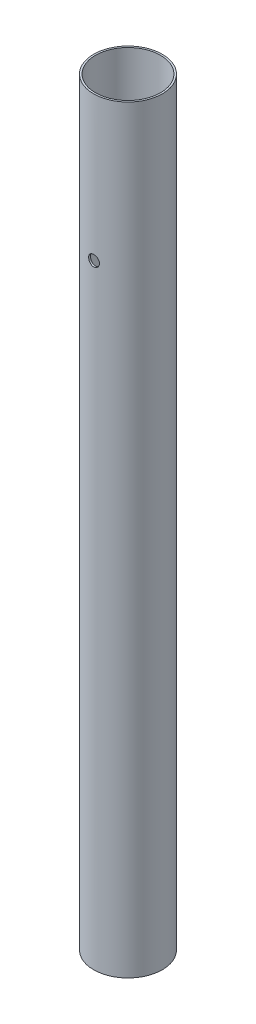
ISO-10303-21;
HEADER;
FILE_DESCRIPTION(('STEP AP214'),'2;1');
FILE_NAME('part.step','',(''),(''),'','','');
FILE_SCHEMA(('AUTOMOTIVE_DESIGN { 1 0 10303 214 1 1 1 1 }'));
ENDSEC;
DATA;
#1=APPLICATION_CONTEXT('core data for automotive mechanical design processes');
#2=APPLICATION_PROTOCOL_DEFINITION('international standard','automotive_design',2000,#1);
#3=PRODUCT_CONTEXT('',#1,'mechanical');
#4=PRODUCT('Part','Part','',(#3));
#5=PRODUCT_RELATED_PRODUCT_CATEGORY('part','',(#4));
#6=PRODUCT_DEFINITION_FORMATION('','',#4);
#7=PRODUCT_DEFINITION_CONTEXT('part definition',#1,'design');
#8=PRODUCT_DEFINITION('design','',#6,#7);
#9=PRODUCT_DEFINITION_SHAPE('','',#8);
#10=(LENGTH_UNIT() NAMED_UNIT(*) SI_UNIT(.MILLI.,.METRE.));
#11=(NAMED_UNIT(*) PLANE_ANGLE_UNIT() SI_UNIT($,.RADIAN.));
#12=(NAMED_UNIT(*) SI_UNIT($,.STERADIAN.) SOLID_ANGLE_UNIT());
#13=UNCERTAINTY_MEASURE_WITH_UNIT(LENGTH_MEASURE(1.E-05),#10,'distance_accuracy_value','');
#14=(GEOMETRIC_REPRESENTATION_CONTEXT(3) GLOBAL_UNCERTAINTY_ASSIGNED_CONTEXT((#13)) GLOBAL_UNIT_ASSIGNED_CONTEXT((#10,
#11,#12)) REPRESENTATION_CONTEXT('',''));
#15=CARTESIAN_POINT('',(0.,0.,0.));
#16=DIRECTION('',(0.,0.,1.));
#17=DIRECTION('',(1.,0.,0.));
#18=AXIS2_PLACEMENT_3D('',#15,#16,#17);
#19=CARTESIAN_POINT('',(0.,210.,0.));
#20=DIRECTION('',(0.,1.,0.));
#21=DIRECTION('',(0.,0.,1.));
#22=AXIS2_PLACEMENT_3D('',#19,#20,#21);
#23=PLANE('',#22);
#24=CARTESIAN_POINT('',(0.,210.,0.));
#25=DIRECTION('',(0.,1.,0.));
#26=DIRECTION('',(0.,0.,1.));
#27=AXIS2_PLACEMENT_3D('',#24,#25,#26);
#28=CIRCLE('',#27,9.5);
#29=CARTESIAN_POINT('',(0.,210.,9.5));
#30=VERTEX_POINT('',#29);
#31=EDGE_CURVE('E10',#30,#30,#28,.T.);
#32=ORIENTED_EDGE('',*,*,#31,.T.);
#33=EDGE_LOOP('',(#32));
#34=FACE_BOUND('',#33,.T.);
#35=CARTESIAN_POINT('',(0.,210.,0.));
#36=DIRECTION('',(0.,1.,0.));
#37=DIRECTION('',(0.,0.,1.));
#38=AXIS2_PLACEMENT_3D('',#35,#36,#37);
#39=CIRCLE('',#38,9.);
#40=CARTESIAN_POINT('',(0.,210.,9.));
#41=VERTEX_POINT('',#40);
#42=EDGE_CURVE('E50',#41,#41,#39,.T.);
#43=ORIENTED_EDGE('',*,*,#42,.F.);
#44=EDGE_LOOP('',(#43));
#45=FACE_BOUND('',#44,.T.);
#46=ADVANCED_FACE('F31',(#34,#45),#23,.T.);
#47=CARTESIAN_POINT('',(0.,0.,0.));
#48=DIRECTION('',(0.,1.,0.));
#49=DIRECTION('',(0.,0.,1.));
#50=AXIS2_PLACEMENT_3D('',#47,#48,#49);
#51=PLANE('',#50);
#52=CARTESIAN_POINT('',(0.,0.,0.));
#53=DIRECTION('',(0.,1.,0.));
#54=DIRECTION('',(0.,0.,1.));
#55=AXIS2_PLACEMENT_3D('',#52,#53,#54);
#56=CIRCLE('',#55,9.5);
#57=CARTESIAN_POINT('',(0.,0.,9.5));
#58=VERTEX_POINT('',#57);
#59=EDGE_CURVE('E45',#58,#58,#56,.T.);
#60=ORIENTED_EDGE('',*,*,#59,.F.);
#61=EDGE_LOOP('',(#60));
#62=FACE_BOUND('',#61,.T.);
#63=CARTESIAN_POINT('',(0.,0.,0.));
#64=DIRECTION('',(0.,1.,0.));
#65=DIRECTION('',(0.,0.,1.));
#66=AXIS2_PLACEMENT_3D('',#63,#64,#65);
#67=CIRCLE('',#66,9.);
#68=CARTESIAN_POINT('',(0.,0.,9.));
#69=VERTEX_POINT('',#68);
#70=EDGE_CURVE('E53',#69,#69,#67,.T.);
#71=ORIENTED_EDGE('',*,*,#70,.T.);
#72=EDGE_LOOP('',(#71));
#73=FACE_BOUND('',#72,.T.);
#74=ADVANCED_FACE('F89',(#62,#73),#51,.F.);
#75=CARTESIAN_POINT('',(0.,210.,0.));
#76=DIRECTION('',(0.,-1.,0.));
#77=DIRECTION('',(0.,0.,-1.));
#78=AXIS2_PLACEMENT_3D('',#75,#76,#77);
#79=CYLINDRICAL_SURFACE('',#78,9.5);
#80=CARTESIAN_POINT('',(0.,171.5,-9.5));
#81=CARTESIAN_POINT('',(-0.0836976001065204,171.499996590751,-9.49999861203618));
#82=CARTESIAN_POINT('',(-0.167442437394014,171.492971054897,-9.49888234231911));
#83=CARTESIAN_POINT('',(-0.332587635211271,171.46506375653,-9.49453678011783));
#84=CARTESIAN_POINT('',(-0.413985694895259,171.444168847928,-9.49130548294469));
#85=CARTESIAN_POINT('',(-0.572023766729422,171.389165821503,-9.48309267200424));
#86=CARTESIAN_POINT('',(-0.648667457404588,171.355068070666,-9.47811253172855));
#87=CARTESIAN_POINT('',(-0.795134710469102,171.274653454461,-9.46695108120927));
#88=CARTESIAN_POINT('',(-0.864959141108904,171.22833814746,-9.46076992418342));
#89=CARTESIAN_POINT('',(-0.996418466512012,171.1243781145,-9.44783324384051));
#90=CARTESIAN_POINT('',(-1.05798606000113,171.066648781236,-9.44107365911176));
#91=CARTESIAN_POINT('',(-1.17060304704611,170.941681518294,-9.42777343334239));
#92=CARTESIAN_POINT('',(-1.22165180906461,170.874443018106,-9.42123280546741));
#93=CARTESIAN_POINT('',(-1.31204764005014,170.731909155531,-9.40907168619827));
#94=CARTESIAN_POINT('',(-1.35132892424658,170.656571585241,-9.40345644380092));
#95=CARTESIAN_POINT('',(-1.4166542181194,170.500264325212,-9.39383775862891));
#96=CARTESIAN_POINT('',(-1.44269902834656,170.419294976424,-9.38983421838048));
#97=CARTESIAN_POINT('',(-1.48060162535859,170.254733051048,-9.38393240557449));
#98=CARTESIAN_POINT('',(-1.49257509267669,170.171167745216,-9.38201697623701));
#99=CARTESIAN_POINT('',(-1.50235362805524,170.003193826942,-9.38045626095234));
#100=CARTESIAN_POINT('',(-1.50015959652364,169.918785268432,-9.38081083073655));
#101=CARTESIAN_POINT('',(-1.48175980710843,169.752342028444,-9.38373437383502));
#102=CARTESIAN_POINT('',(-1.46568339888114,169.670292636708,-9.38628290415411));
#103=CARTESIAN_POINT('',(-1.4201779253579,169.510070603926,-9.39327524902392));
#104=CARTESIAN_POINT('',(-1.39074844516594,169.431898083422,-9.39771912246497));
#105=CARTESIAN_POINT('',(-1.3192392577636,169.281258187251,-9.40802379337808));
#106=CARTESIAN_POINT('',(-1.27710525865785,169.208817015619,-9.41389065039575));
#107=CARTESIAN_POINT('',(-1.1814216728908,169.07198394791,-9.42637594353948));
#108=CARTESIAN_POINT('',(-1.12787125747699,169.007592636735,-9.43299443421261));
#109=CARTESIAN_POINT('',(-1.01016734202821,168.887937883401,-9.44632735425788));
#110=CARTESIAN_POINT('',(-0.945902736525766,168.83278370453,-9.45304203303564));
#111=CARTESIAN_POINT('',(-0.808972007834455,168.734026078572,-9.46574266984972));
#112=CARTESIAN_POINT('',(-0.736305840302173,168.690422692452,-9.47172862403949));
#113=CARTESIAN_POINT('',(-0.58453630688462,168.61599678625,-9.48230461469925));
#114=CARTESIAN_POINT('',(-0.505428458120286,168.585183259369,-9.48689366833474));
#115=CARTESIAN_POINT('',(-0.343072096390943,168.537309692998,-9.49415073946819));
#116=CARTESIAN_POINT('',(-0.259823894418563,168.520248622178,-9.49681890101704));
#117=CARTESIAN_POINT('',(-0.0924923680311061,168.500510863084,-9.49991434597553));
#118=CARTESIAN_POINT('',(-0.00842716740137882,168.497684061576,-9.50036501369999));
#119=CARTESIAN_POINT('',(0.158976265712531,168.506095824844,-9.49903852875433));
#120=CARTESIAN_POINT('',(0.24231452311222,168.517333905633,-9.4972614527432));
#121=CARTESIAN_POINT('',(0.405439567370632,168.553431581316,-9.49169362069365));
#122=CARTESIAN_POINT('',(0.485243062795079,168.578217495579,-9.48791376028194));
#123=CARTESIAN_POINT('',(0.639561861197122,168.640629167573,-9.47876264558505));
#124=CARTESIAN_POINT('',(0.714076892756956,168.678255583736,-9.4733913096943));
#125=CARTESIAN_POINT('',(0.856359938682373,168.76562849511,-9.4615955819989));
#126=CARTESIAN_POINT('',(0.924069207311129,168.815469543787,-9.45516310943481));
#127=CARTESIAN_POINT('',(1.05021609132262,168.925726002589,-9.44198475905152));
#128=CARTESIAN_POINT('',(1.10865310573566,168.986142097589,-9.43523886095462));
#129=CARTESIAN_POINT('',(1.21514760920431,169.116504265563,-9.42211913600068));
#130=CARTESIAN_POINT('',(1.26310409838576,169.186533313588,-9.41574932753235));
#131=CARTESIAN_POINT('',(1.34657266649326,169.333741312266,-9.40417594303638));
#132=CARTESIAN_POINT('',(1.38208510941916,169.4109200537,-9.39897233289797));
#133=CARTESIAN_POINT('',(1.43950349612765,169.569944110939,-9.39035010587673));
#134=CARTESIAN_POINT('',(1.46146126125825,169.651770331162,-9.38692469878068));
#135=CARTESIAN_POINT('',(1.49131110199775,169.81800766724,-9.38222912838246));
#136=CARTESIAN_POINT('',(1.49920426388363,169.902418582954,-9.38095879863367));
#137=CARTESIAN_POINT('',(1.5006729373316,170.070421672991,-9.38072387634563));
#138=CARTESIAN_POINT('',(1.49440732883688,170.15401246558,-9.38173369742788));
#139=CARTESIAN_POINT('',(1.46807821019622,170.31893513302,-9.38588947240367));
#140=CARTESIAN_POINT('',(1.44801473210917,170.400267013119,-9.38903542133397));
#141=CARTESIAN_POINT('',(1.39471776903662,170.558311064846,-9.39709967714348));
#142=CARTESIAN_POINT('',(1.3614965806929,170.635027473008,-9.40201632881049));
#143=CARTESIAN_POINT('',(1.28284324745908,170.781823568325,-9.41306982252276));
#144=CARTESIAN_POINT('',(1.23741059974181,170.851902982031,-9.41920671481075));
#145=CARTESIAN_POINT('',(1.13505145080214,170.984240968063,-9.4320909582884));
#146=CARTESIAN_POINT('',(1.0780076272868,171.046408241589,-9.43884411780419));
#147=CARTESIAN_POINT('',(0.954293245344258,171.160343480553,-9.45215249855794));
#148=CARTESIAN_POINT('',(0.887620460616881,171.212109034385,-9.4587076735952));
#149=CARTESIAN_POINT('',(0.746056649485077,171.30405856521,-9.47092780190555));
#150=CARTESIAN_POINT('',(0.671117681090879,171.344169487173,-9.47658704267683));
#151=CARTESIAN_POINT('',(0.515509688205488,171.411173596546,-9.48632189921254));
#152=CARTESIAN_POINT('',(0.434846589899649,171.438080232267,-9.49039912533837));
#153=CARTESIAN_POINT('',(0.294869549677877,171.471929091052,-9.4955986667772));
#154=CARTESIAN_POINT('',(0.236411965071409,171.482439241916,-9.49724053176745));
#155=CARTESIAN_POINT('',(0.118644158414184,171.496475854084,-9.49944168248486));
#156=CARTESIAN_POINT('',(0.0593339487629808,171.500002416846,-9.50000098393949));
#157=CARTESIAN_POINT('',(0.,171.5,-9.5));
#158=B_SPLINE_CURVE_WITH_KNOTS('',3,(#80,#81,#82,#83,#84,#85,#86,#87,#88,#89,#90,#91,#92,#93,
#94,#95,#96,#97,#98,#99,#100,#101,#102,#103,#104,#105,#106,#107,#108,#109,#110,#111,#112,#113,
#114,#115,#116,#117,#118,#119,#120,#121,#122,#123,#124,#125,#126,#127,#128,#129,#130,#131,#132,
#133,#134,#135,#136,#137,#138,#139,#140,#141,#142,#143,#144,#145,#146,#147,#148,#149,#150,#151,
#152,#153,#154,#155,#156,#157),.UNSPECIFIED.,.T.,.F.,(4,2,2,2,2,2,2,2,2,2,2,2,2,2,2,2,2,2,2,2,2,
2,2,2,2,2,2,2,2,2,2,2,2,2,2,2,2,2,4),(0.,0.250875955706264,0.501990044469081,0.752907354824661,
1.00379267580461,1.2566125744651,1.50944764769343,1.76367086508285,2.01787870505205,
2.26998174901984,2.52206877086914,2.77183199835413,3.02160298681439,3.27245685757922,
3.52332894479685,3.77698595667627,4.03064430741766,4.28448071735227,4.53829808968866,
4.78943303847652,5.0405593456862,5.2903332848928,5.54012003389346,5.79190509693549,
6.04370647245532,6.29783677445572,6.55195964228956,6.80510484781958,7.05823050087968,
7.30852987505233,7.55882866766461,7.80889409144678,8.05896981366681,8.31171040651356,
8.56450952903009,8.81886068521236,9.07295224922779,9.25080295634069,9.42865107961777),.UNSPECIFIED.);
#159=CARTESIAN_POINT('',(0.,171.5,-9.5));
#160=VERTEX_POINT('',#159);
#161=EDGE_CURVE('E78',#160,#160,#158,.T.);
#162=ORIENTED_EDGE('',*,*,#161,.T.);
#163=EDGE_LOOP('',(#162));
#164=FACE_BOUND('',#163,.T.);
#165=CARTESIAN_POINT('',(1.5,170.,9.38083151964686));
#166=CARTESIAN_POINT('',(1.49999658455055,169.916309730994,9.38083297404066));
#167=CARTESIAN_POINT('',(1.49297223784084,169.83257220576,9.38196360092028));
#168=CARTESIAN_POINT('',(1.46507009131939,169.667442196307,9.38636039550341));
#169=CARTESIAN_POINT('',(1.44417911871312,169.58605201877,9.38962859377943));
#170=CARTESIAN_POINT('',(1.38918760267279,169.428030626815,9.39792135372632));
#171=CARTESIAN_POINT('',(1.35509761216466,169.351395667139,9.40294451195283));
#172=CARTESIAN_POINT('',(1.27470128030859,169.204943089764,9.414179545352));
#173=CARTESIAN_POINT('',(1.22839647880733,169.135124614273,9.42039127066217));
#174=CARTESIAN_POINT('',(1.12444713836387,169.003658755913,9.43336503838525));
#175=CARTESIAN_POINT('',(1.06671563821398,168.942080515686,9.44013105201471));
#176=CARTESIAN_POINT('',(0.941739545888724,168.829442925427,9.45341567106039));
#177=CARTESIAN_POINT('',(0.874494412511279,168.778384174223,9.45993426237471));
#178=CARTESIAN_POINT('',(0.731954548292164,168.687977744035,9.47203134599669));
#179=CARTESIAN_POINT('',(0.656618750818359,168.648694057007,9.47760463238817));
#180=CARTESIAN_POINT('',(0.500315336961971,168.583363834375,9.48713906529767));
#181=CARTESIAN_POINT('',(0.419348049999343,168.557316525233,9.49110030602129));
#182=CARTESIAN_POINT('',(0.25479321450393,168.519408932187,9.49693629805995));
#183=CARTESIAN_POINT('',(0.171232996932499,168.507432673184,9.4988280968723));
#184=CARTESIAN_POINT('',(0.00326909893889104,168.497646790535,9.5003705446193));
#185=CARTESIAN_POINT('',(-0.0811345294603289,168.499836298441,9.50002133094164));
#186=CARTESIAN_POINT('',(-0.247597304848639,168.518228771821,9.49713466336618));
#187=CARTESIAN_POINT('',(-0.3296706258939,168.534306947759,9.49461669627846));
#188=CARTESIAN_POINT('',(-0.489939598315301,168.579824191671,9.48769715323518));
#189=CARTESIAN_POINT('',(-0.568135141212466,168.609263633184,9.48329552461823));
#190=CARTESIAN_POINT('',(-0.718803540216121,168.680793756153,9.47306987014884));
#191=CARTESIAN_POINT('',(-0.791251288178859,168.722936457125,9.46724001448607));
#192=CARTESIAN_POINT('',(-0.928093849593969,168.818638783527,9.45480671150476));
#193=CARTESIAN_POINT('',(-0.992488076174243,168.872199240216,9.44820320787719));
#194=CARTESIAN_POINT('',(-1.1121320674923,168.989910476114,9.43487320037046));
#195=CARTESIAN_POINT('',(-1.16727457805413,169.05417026277,9.42814614020982));
#196=CARTESIAN_POINT('',(-1.26601092962898,169.191087124167,9.41539709463343));
#197=CARTESIAN_POINT('',(-1.30960468415934,169.263744261786,9.40937511449785));
#198=CARTESIAN_POINT('',(-1.38402357522716,169.415510946437,9.39871800561222));
#199=CARTESIAN_POINT('',(-1.4148368179779,169.494626422159,9.39408416980429));
#200=CARTESIAN_POINT('',(-1.46270749784294,169.656999420591,9.38675017598398));
#201=CARTESIAN_POINT('',(-1.47976601505946,169.740256617523,9.38404986614158));
#202=CARTESIAN_POINT('',(-1.49949411042943,169.907592955659,9.38091773533559));
#203=CARTESIAN_POINT('',(-1.50231612080203,169.991653691218,9.38046188392375));
#204=CARTESIAN_POINT('',(-1.4938963689811,170.159047058933,9.38180638869071));
#205=CARTESIAN_POINT('',(-1.48265509215639,170.242379716117,9.38360666700331));
#206=CARTESIAN_POINT('',(-1.44655746438407,170.405473669363,9.38923845197488));
#207=CARTESIAN_POINT('',(-1.42177781446732,170.485252371713,9.39305851175888));
#208=CARTESIAN_POINT('',(-1.35938693205191,170.639524340716,9.4022899197254));
#209=CARTESIAN_POINT('',(-1.3217750034913,170.714017320389,9.40770135422673));
#210=CARTESIAN_POINT('',(-1.23442398163625,170.856284315317,9.41956203589073));
#211=CARTESIAN_POINT('',(-1.18458667109845,170.923997325605,9.42601953670219));
#212=CARTESIAN_POINT('',(-1.07433532022965,171.050153488593,9.43922022959441));
#213=CARTESIAN_POINT('',(-1.01392061491125,171.10859605803,9.44596343961713));
#214=CARTESIAN_POINT('',(-0.883556250112777,171.215104037933,9.45905128553892));
#215=CARTESIAN_POINT('',(-0.813523322567932,171.263068133763,9.46539164279549));
#216=CARTESIAN_POINT('',(-0.666305394879827,171.346550031229,9.47689193046182));
#217=CARTESIAN_POINT('',(-0.589120607345019,171.382068202704,9.48205189594613));
#218=CARTESIAN_POINT('',(-0.430099180755803,171.439490080176,9.49059133505206));
#219=CARTESIAN_POINT('',(-0.348282544696119,171.461448081895,9.49397790107197));
#220=CARTESIAN_POINT('',(-0.182065541000527,171.49130163797,9.49861883842448));
#221=CARTESIAN_POINT('',(-0.0976653637496369,171.499198226007,9.49987336648691));
#222=CARTESIAN_POINT('',(0.0703424890561658,171.500677486119,9.50010700904781));
#223=CARTESIAN_POINT('',(0.153948809855681,171.494414773802,9.49911070212592));
#224=CARTESIAN_POINT('',(0.318903288593768,171.468086009826,9.49500446266303));
#225=CARTESIAN_POINT('',(0.400251456141505,171.448020016915,9.4918945391176));
#226=CARTESIAN_POINT('',(0.558330315524413,171.394711238641,9.48390902705529));
#227=CARTESIAN_POINT('',(0.635065084473797,171.36148029105,9.47903502511627));
#228=CARTESIAN_POINT('',(0.78189387143712,171.282801713074,9.46805518209959));
#229=CARTESIAN_POINT('',(0.851987627392477,171.237353600862,9.46194929244058));
#230=CARTESIAN_POINT('',(0.984326499290177,171.134976723638,9.44910438099924));
#231=CARTESIAN_POINT('',(1.04648306132952,171.077934215668,9.44235947063351));
#232=CARTESIAN_POINT('',(1.16039729972464,170.954226966935,9.42903896923987));
#233=CARTESIAN_POINT('',(1.21215253557012,170.887559974227,9.42246341826431));
#234=CARTESIAN_POINT('',(1.30409009743287,170.746001568518,9.41018172735959));
#235=CARTESIAN_POINT('',(1.34419772972858,170.671061150686,9.40448130469082));
#236=CARTESIAN_POINT('',(1.41119529560835,170.515450247748,9.39466254048804));
#237=CARTESIAN_POINT('',(1.43809871074205,170.434785703743,9.39054258623338));
#238=CARTESIAN_POINT('',(1.47193913254667,170.294817128211,9.38528558640041));
#239=CARTESIAN_POINT('',(1.48244550005068,170.236370034016,9.38362436450214));
#240=CARTESIAN_POINT('',(1.49647709113171,170.118623199367,9.38139682399235));
#241=CARTESIAN_POINT('',(1.50000242102603,170.059323471912,9.38083048870633));
#242=CARTESIAN_POINT('',(1.5,170.,9.38083151964686));
#243=B_SPLINE_CURVE_WITH_KNOTS('',3,(#165,#166,#167,#168,#169,#170,#171,#172,#173,#174,#175,
#176,#177,#178,#179,#180,#181,#182,#183,#184,#185,#186,#187,#188,#189,#190,#191,#192,#193,#194,
#195,#196,#197,#198,#199,#200,#201,#202,#203,#204,#205,#206,#207,#208,#209,#210,#211,#212,#213,
#214,#215,#216,#217,#218,#219,#220,#221,#222,#223,#224,#225,#226,#227,#228,#229,#230,#231,#232,
#233,#234,#235,#236,#237,#238,#239,#240,#241,#242),.UNSPECIFIED.,.T.,.F.,(4,2,2,2,2,2,2,2,2,2,2,
2,2,2,2,2,2,2,2,2,2,2,2,2,2,2,2,2,2,2,2,2,2,2,2,2,2,2,4),(0.,0.250853927262134,
0.501946498416266,0.752838728320962,1.00369934487583,1.2565480788977,1.50941120251429,
1.76362459165417,2.01782312279829,2.26991148848838,2.52198439977627,2.77181572176524,
3.02165402872709,3.27252964579773,3.52342353390932,3.77705047333305,4.03067931198402,
4.28454365571374,4.53838806257511,4.7895086664625,5.04062060361752,5.29032441173719,
5.54004176670729,5.79183509438419,6.04364425767607,6.29778980620822,6.55192780199649,
6.80504150202871,7.05813659442522,7.3084813238685,7.55882498785124,7.80894405482682,
8.05907298755213,8.3117856936091,8.56455762574337,8.81891644248642,9.07301501496297,
9.25083440456604,9.42865108605879),.UNSPECIFIED.);
#244=CARTESIAN_POINT('',(1.5,170.,9.38083151964686));
#245=VERTEX_POINT('',#244);
#246=EDGE_CURVE('E73',#245,#245,#243,.T.);
#247=ORIENTED_EDGE('',*,*,#246,.T.);
#248=EDGE_LOOP('',(#247));
#249=FACE_BOUND('',#248,.T.);
#250=ORIENTED_EDGE('',*,*,#31,.F.);
#251=EDGE_LOOP('',(#250));
#252=FACE_BOUND('',#251,.T.);
#253=ORIENTED_EDGE('',*,*,#59,.T.);
#254=EDGE_LOOP('',(#253));
#255=FACE_BOUND('',#254,.T.);
#256=ADVANCED_FACE('F33',(#164,#249,#252,#255),#79,.T.);
#257=CARTESIAN_POINT('',(0.,210.,0.));
#258=DIRECTION('',(0.,-1.,0.));
#259=DIRECTION('',(0.,0.,-1.));
#260=AXIS2_PLACEMENT_3D('',#257,#258,#259);
#261=CYLINDRICAL_SURFACE('',#260,9.);
#262=CARTESIAN_POINT('',(0.,171.5,-9.));
#263=CARTESIAN_POINT('',(-0.0836345429749285,171.499996646631,-8.99999856701294));
#264=CARTESIAN_POINT('',(-0.167314729103292,171.492981635019,-8.9988220674782));
#265=CARTESIAN_POINT('',(-0.332328133003824,171.465118604741,-8.99424206964832));
#266=CARTESIAN_POINT('',(-0.413659120775546,171.444257865853,-8.99083652354334));
#267=CARTESIAN_POINT('',(-0.571562848327585,171.389350730844,-8.9821804094187));
#268=CARTESIAN_POINT('',(-0.64813942105914,171.355315120616,-8.97693135095516));
#269=CARTESIAN_POINT('',(-0.794485105186768,171.275052624769,-8.96516536249242));
#270=CARTESIAN_POINT('',(-0.864254993927156,171.22882713351,-8.9586485775266));
#271=CARTESIAN_POINT('',(-0.995683568575008,171.125026949708,-8.94499990474988));
#272=CARTESIAN_POINT('',(-1.05726774212098,171.067358531218,-8.93786323088914));
#273=CARTESIAN_POINT('',(-1.16993309919595,170.942511218916,-8.92381576126039));
#274=CARTESIAN_POINT('',(-1.22101361963458,170.875331725126,-8.916904979776));
#275=CARTESIAN_POINT('',(-1.31152027536308,170.732857420282,-8.90404539455868));
#276=CARTESIAN_POINT('',(-1.3508727317166,170.657515197917,-8.89810277454981));
#277=CARTESIAN_POINT('',(-1.41633501924673,170.50117426142,-8.88791873876805));
#278=CARTESIAN_POINT('',(-1.44244574493937,170.420175929793,-8.88367720808584));
#279=CARTESIAN_POINT('',(-1.48044862667088,170.255611835086,-8.87742322105653));
#280=CARTESIAN_POINT('',(-1.49246941748124,170.172076558099,-8.8753906109142));
#281=CARTESIAN_POINT('',(-1.50235003517393,170.00415183387,-8.87372363361989));
#282=CARTESIAN_POINT('',(-1.5002108642334,169.9197624475,-8.87408909674328));
#283=CARTESIAN_POINT('',(-1.48193705903769,169.753443283235,-8.87715857318133));
#284=CARTESIAN_POINT('',(-1.46594692913387,169.671497117873,-8.8798384399135));
#285=CARTESIAN_POINT('',(-1.42065188424207,169.511467209303,-8.88719697126605));
#286=CARTESIAN_POINT('',(-1.39134651259185,169.433383598667,-8.89187570443963));
#287=CARTESIAN_POINT('',(-1.32010634765635,169.282862705935,-8.9027308760046));
#288=CARTESIAN_POINT('',(-1.27811154832783,169.210454356351,-8.90891440264395));
#289=CARTESIAN_POINT('',(-1.18272721053446,169.073657359677,-8.92207751049005));
#290=CARTESIAN_POINT('',(-1.12933675239258,169.009269360527,-8.92905715592572));
#291=CARTESIAN_POINT('',(-1.01188932729543,168.889504348516,-8.94313216727871));
#292=CARTESIAN_POINT('',(-0.947708378323876,168.834248888876,-8.95022789538991));
#293=CARTESIAN_POINT('',(-0.810921149388988,168.735273342401,-8.96365560838034));
#294=CARTESIAN_POINT('',(-0.738314815143854,168.69155332989,-8.96998758833847));
#295=CARTESIAN_POINT('',(-0.586623549700028,168.616878663718,-8.98118335735747));
#296=CARTESIAN_POINT('',(-0.507533235338799,168.585934748401,-8.98604591044468));
#297=CARTESIAN_POINT('',(-0.34517900736164,168.537803470852,-8.99374501807596));
#298=CARTESIAN_POINT('',(-0.26191544350768,168.520614957816,-8.99658174210284));
#299=CARTESIAN_POINT('',(-0.0946259407809719,168.500647184923,-8.99988677905612));
#300=CARTESIAN_POINT('',(-0.0106204422906043,168.497701056917,-9.00038251807671));
#301=CARTESIAN_POINT('',(0.156683863733934,168.505856806657,-8.99902484652702));
#302=CARTESIAN_POINT('',(0.239982698335223,168.51695814388,-8.99717152634471));
#303=CARTESIAN_POINT('',(0.402993705328054,168.552754909601,-8.99134096162921));
#304=CARTESIAN_POINT('',(0.48272452103122,168.577367725034,-8.98737662880787));
#305=CARTESIAN_POINT('',(0.636928130916258,168.63940071092,-8.97776678673215));
#306=CARTESIAN_POINT('',(0.711400629545827,168.676821600581,-8.97212118307212));
#307=CARTESIAN_POINT('',(0.853698413681378,168.763790674818,-8.95970709781445));
#308=CARTESIAN_POINT('',(0.921459150562295,168.8134430937,-8.95292913532213));
#309=CARTESIAN_POINT('',(1.04774615130162,168.923322389231,-8.9390308043514));
#310=CARTESIAN_POINT('',(1.10627174381795,168.983550033966,-8.93191041102928));
#311=CARTESIAN_POINT('',(1.21304566779481,169.113618528843,-8.91804105141507));
#312=CARTESIAN_POINT('',(1.26118125666825,169.183552499309,-8.91129669682263));
#313=CARTESIAN_POINT('',(1.345021386177,169.330611781483,-8.8990291786673));
#314=CARTESIAN_POINT('',(1.38072632086189,169.407736865136,-8.89350597639612));
#315=CARTESIAN_POINT('',(1.43852299888389,169.566673839687,-8.88434072218623));
#316=CARTESIAN_POINT('',(1.46067085952877,169.648464857018,-8.88069092586639));
#317=CARTESIAN_POINT('',(1.49090127226697,169.814672077533,-8.87566630101156));
#318=CARTESIAN_POINT('',(1.4989850471677,169.899088051839,-8.87429127469633));
#319=CARTESIAN_POINT('',(1.50082371962841,170.067023099577,-8.87398039850407));
#320=CARTESIAN_POINT('',(1.49475608167512,170.150540227145,-8.8750143390339));
#321=CARTESIAN_POINT('',(1.46884790337412,170.31534754883,-8.87933868872237));
#322=CARTESIAN_POINT('',(1.44900740766749,170.396637750165,-8.88262909056728));
#323=CARTESIAN_POINT('',(1.39618469375695,170.554615062376,-8.89108413769031));
#324=CARTESIAN_POINT('',(1.36321775436028,170.631307406034,-8.89624660331802));
#325=CARTESIAN_POINT('',(1.28509620234956,170.778101401517,-8.90786621353324));
#326=CARTESIAN_POINT('',(1.23994098524915,170.848202726223,-8.91432342233039));
#327=CARTESIAN_POINT('',(1.1380913306233,170.980721349865,-8.92790072427373));
#328=CARTESIAN_POINT('',(1.08126633815619,171.04303761002,-8.93502777345781));
#329=CARTESIAN_POINT('',(0.95796541882814,171.157310962685,-8.94908623416504));
#330=CARTESIAN_POINT('',(0.891487267747582,171.209265661183,-8.95601760015928));
#331=CARTESIAN_POINT('',(0.750221501784171,171.30166896092,-8.96895917785332));
#332=CARTESIAN_POINT('',(0.675379672519698,171.342035623588,-8.97496269751863));
#333=CARTESIAN_POINT('',(0.5199078416274,171.409561690766,-8.98530700561065));
#334=CARTESIAN_POINT('',(0.439283696898017,171.436734248648,-8.98964944906489));
#335=CARTESIAN_POINT('',(0.298621986027251,171.471203164476,-8.99523474499773));
#336=CARTESIAN_POINT('',(0.239435298179077,171.48198468177,-8.99701216364015));
#337=CARTESIAN_POINT('',(0.12017358619189,171.496384242707,-8.99939529591672));
#338=CARTESIAN_POINT('',(0.0600985773650987,171.500002409682,-9.00000102972385));
#339=CARTESIAN_POINT('',(0.,171.5,-9.));
#340=B_SPLINE_CURVE_WITH_KNOTS('',3,(#262,#263,#264,#265,#266,#267,#268,#269,#270,#271,#272,
#273,#274,#275,#276,#277,#278,#279,#280,#281,#282,#283,#284,#285,#286,#287,#288,#289,#290,#291,
#292,#293,#294,#295,#296,#297,#298,#299,#300,#301,#302,#303,#304,#305,#306,#307,#308,#309,#310,
#311,#312,#313,#314,#315,#316,#317,#318,#319,#320,#321,#322,#323,#324,#325,#326,#327,#328,#329,
#330,#331,#332,#333,#334,#335,#336,#337,#338,#339),.UNSPECIFIED.,.T.,.F.,(4,2,2,2,2,2,2,2,2,2,2,
2,2,2,2,2,2,2,2,2,2,2,2,2,2,2,2,2,2,2,2,2,2,2,2,2,2,2,4),(0.,0.250683950963103,
0.501598527417252,0.75230812021517,1.00298904760486,1.25581494637399,1.50865680101914,
1.76305512494304,2.01743626125706,2.26947646262051,2.5214988259253,2.77092313056243,
3.02035599015228,3.27098733979534,3.52163892408343,3.77539661946794,4.02915594981509,
4.28312813349542,4.5370790671269,4.78804730094839,5.03900587821516,5.28844684203848,
5.53790181495639,5.78956095376215,6.0412383783257,6.29552293204577,6.54979942425565,
6.80301613405063,7.05621082671967,7.30624745713618,7.55628327712878,7.80602890935732,
8.05578693017601,8.30850830516035,8.56128800327384,8.81581338964319,9.07008451278042,
9.25022548898411,9.43036336366181),.UNSPECIFIED.);
#341=CARTESIAN_POINT('',(0.,171.5,-9.));
#342=VERTEX_POINT('',#341);
#343=EDGE_CURVE('E36',#342,#342,#340,.T.);
#344=ORIENTED_EDGE('',*,*,#343,.F.);
#345=EDGE_LOOP('',(#344));
#346=FACE_BOUND('',#345,.T.);
#347=CARTESIAN_POINT('',(1.5,170.,8.87411967464942));
#348=CARTESIAN_POINT('',(1.4999966390526,169.916374551112,8.87412118440766));
#349=CARTESIAN_POINT('',(1.49298310142239,169.832703436385,8.8753145552884));
#350=CARTESIAN_POINT('',(1.46512645684524,169.667708874068,8.87995474420907));
#351=CARTESIAN_POINT('',(1.44427059618579,169.58638766375,8.88340364034856));
#352=CARTESIAN_POINT('',(1.38937772620029,169.428504629986,8.89215365593394));
#353=CARTESIAN_POINT('',(1.35535173295866,169.3519388908,8.8974532270317));
#354=CARTESIAN_POINT('',(1.27511189813422,169.205611427172,8.90930563268603));
#355=CARTESIAN_POINT('',(1.22889942810094,169.135848938254,8.91585832618484));
#356=CARTESIAN_POINT('',(1.12511251617979,169.004412290153,8.92955082691565));
#357=CARTESIAN_POINT('',(1.06744142935939,168.942814921168,8.93669530396241));
#358=CARTESIAN_POINT('',(0.942583202817229,168.830124015883,8.95072488401674));
#359=CARTESIAN_POINT('',(0.87539549949001,168.779031102131,8.95760997163182));
#360=CARTESIAN_POINT('',(0.732913721969014,168.688511259668,8.97039442189481));
#361=CARTESIAN_POINT('',(0.657573648874038,168.649155795361,8.97628765459366));
#362=CARTESIAN_POINT('',(0.501237373034338,168.583687357682,8.98637242174293));
#363=CARTESIAN_POINT('',(0.420241538446923,168.557573523269,8.99056406683605));
#364=CARTESIAN_POINT('',(0.255686235806551,168.51956447901,8.99674040834627));
#365=CARTESIAN_POINT('',(0.172157332007571,168.507540250397,8.99874511866543));
#366=CARTESIAN_POINT('',(0.00424517131548999,168.497650547508,9.00039047605668));
#367=CARTESIAN_POINT('',(-0.0801380271173271,168.499784110852,9.00003128381585));
#368=CARTESIAN_POINT('',(-0.246481311047316,168.518048810917,8.99700515058833));
#369=CARTESIAN_POINT('',(-0.328457118420079,168.534041098045,8.99436110215438));
#370=CARTESIAN_POINT('',(-0.488545187767068,168.579350644548,8.98708787262982));
#371=CARTESIAN_POINT('',(-0.566657331990893,168.608668309754,8.98245863107927));
#372=CARTESIAN_POINT('',(-0.717213688669577,168.679934384189,8.97169619107174));
#373=CARTESIAN_POINT('',(-0.789630313811416,168.721940007249,8.96555620396128));
#374=CARTESIAN_POINT('',(-0.926439317907975,168.817347693581,8.95245442842898));
#375=CARTESIAN_POINT('',(-0.990831046749513,168.870750679226,8.94549257351481));
#376=CARTESIAN_POINT('',(-1.11058276406799,168.988207283972,8.93142160939558));
#377=CARTESIAN_POINT('',(-1.16582370135193,169.052382256941,8.92431173838625));
#378=CARTESIAN_POINT('',(-1.26477275306885,169.189152254129,8.91082775870883));
#379=CARTESIAN_POINT('',(-1.30848076111946,169.26174735601,8.90445365682795));
#380=CARTESIAN_POINT('',(-1.38314666069298,169.413434985126,8.8931625273709));
#381=CARTESIAN_POINT('',(-1.41409021636756,169.492534698855,8.88824713981561));
#382=CARTESIAN_POINT('',(-1.46221792248938,169.654909443385,8.88045713213928));
#383=CARTESIAN_POINT('',(-1.47940328446077,169.738184105859,8.87758233232993));
#384=CARTESIAN_POINT('',(-1.49935913092756,169.905479693697,8.8742337565327));
#385=CARTESIAN_POINT('',(-1.50229932474746,169.989479827821,8.87373171455201));
#386=CARTESIAN_POINT('',(-1.49413362160948,170.156772003014,8.87511020869417));
#387=CARTESIAN_POINT('',(-1.4830282671748,170.240064071308,8.87699065279112));
#388=CARTESIAN_POINT('',(-1.44723140095686,170.403036655514,8.88289612473011));
#389=CARTESIAN_POINT('',(-1.42262627438783,170.482736683927,8.88690751151009));
#390=CARTESIAN_POINT('',(-1.36061891411537,170.636882099768,8.89661143803301));
#391=CARTESIAN_POINT('',(-1.32321591486056,170.711327172531,8.90230407834347));
#392=CARTESIAN_POINT('',(-1.23627400393753,170.853604756644,8.91479477038436));
#393=CARTESIAN_POINT('',(-1.18662633849561,170.921369943654,8.92160253360208));
#394=CARTESIAN_POINT('',(-1.07675367942478,171.047668119617,8.9355280000792));
#395=CARTESIAN_POINT('',(-1.01652794183042,171.106200458666,8.94264572511199));
#396=CARTESIAN_POINT('',(-0.88645684219728,171.212991135637,8.95647853270958));
#397=CARTESIAN_POINT('',(-0.816517952031711,171.261136295771,8.96318865806804));
#398=CARTESIAN_POINT('',(-0.669446068769586,171.344993196203,8.97537067459765));
#399=CARTESIAN_POINT('',(-0.592313308482365,171.380705338684,8.98084260581986));
#400=CARTESIAN_POINT('',(-0.433379430900791,171.438506350373,8.9899101490175));
#401=CARTESIAN_POINT('',(-0.351600337561567,171.460654445441,8.99351390740573));
#402=CARTESIAN_POINT('',(-0.185418440924536,171.490889359378,8.99847349901569));
#403=CARTESIAN_POINT('',(-0.101015854092985,171.498977335239,8.99982951720106));
#404=CARTESIAN_POINT('',(0.0669247654641973,171.500829129387,9.00013822732695));
#405=CARTESIAN_POINT('',(0.150460896361597,171.494765152365,8.99911981214543));
#406=CARTESIAN_POINT('',(0.315307184588805,171.468857646638,8.9948530703237));
#407=CARTESIAN_POINT('',(0.396617354380446,171.449014195094,8.99160475617001));
#408=CARTESIAN_POINT('',(0.554637867551142,171.396177100674,8.98324193296551));
#409=CARTESIAN_POINT('',(0.631353223292395,171.363198099074,8.97812950224933));
#410=CARTESIAN_POINT('',(0.77818827178916,171.285045238262,8.96659654126411));
#411=CARTESIAN_POINT('',(0.848307651670464,171.239870800963,8.96017594898929));
#412=CARTESIAN_POINT('',(0.98082776731629,171.137998944523,8.94664577771383));
#413=CARTESIAN_POINT('',(1.04313085836337,171.081175427146,8.9395291473044));
#414=CARTESIAN_POINT('',(1.15737832556883,170.957883015261,8.92545781982852));
#415=CARTESIAN_POINT('',(1.20932027202072,170.891411864665,8.91850316108162));
#416=CARTESIAN_POINT('',(1.30170856255178,170.750152806495,8.90549006142059));
#417=CARTESIAN_POINT('',(1.34207099345673,170.675309396097,8.89943830788741));
#418=CARTESIAN_POINT('',(1.40958872186455,170.519834458453,8.88899526133062));
#419=CARTESIAN_POINT('',(1.43675721313897,170.439208806382,8.88460231050764));
#420=CARTESIAN_POINT('',(1.47121563187329,170.298557738314,8.87894846902668));
#421=CARTESIAN_POINT('',(1.48199245060217,170.239383915225,8.8771477405261));
#422=CARTESIAN_POINT('',(1.49638577710945,170.120147909095,8.87473281171912));
#423=CARTESIAN_POINT('',(1.50000241487516,170.060085742202,8.87411858987266));
#424=CARTESIAN_POINT('',(1.5,170.,8.87411967464942));
#425=B_SPLINE_CURVE_WITH_KNOTS('',3,(#347,#348,#349,#350,#351,#352,#353,#354,#355,#356,#357,
#358,#359,#360,#361,#362,#363,#364,#365,#366,#367,#368,#369,#370,#371,#372,#373,#374,#375,#376,
#377,#378,#379,#380,#381,#382,#383,#384,#385,#386,#387,#388,#389,#390,#391,#392,#393,#394,#395,
#396,#397,#398,#399,#400,#401,#402,#403,#404,#405,#406,#407,#408,#409,#410,#411,#412,#413,#414,
#415,#416,#417,#418,#419,#420,#421,#422,#423,#424),.UNSPECIFIED.,.T.,.F.,(4,2,2,2,2,2,2,2,2,2,2,
2,2,2,2,2,2,2,2,2,2,2,2,2,2,2,2,2,2,2,2,2,2,2,2,2,2,2,4),(0.,0.250656623343192,
0.501544511951658,0.75222299869901,1.00287328440552,1.25573495490815,1.50861160698055,
1.76299788064248,2.01736761064056,2.26938940480927,2.52139406789002,2.77090272696189,
3.02041898547107,3.27107762481041,3.52175655733446,3.77547674074663,4.02919926445001,
4.28320597496553,4.53719031560234,4.78814125449633,5.03908250045774,5.2884363877868,
5.53780519373534,5.78947405655009,6.04116062655802,6.29546467818619,6.54976050283408,
6.80293790647975,7.05609447544798,7.30618665756937,7.55627743928681,7.8060902389686,
8.05591488232788,8.3086019847534,8.56134827326476,8.81588236567713,9.07016140042578,
9.25026402322163,9.43036337636995),.UNSPECIFIED.);
#426=CARTESIAN_POINT('',(1.5,170.,8.87411967464942));
#427=VERTEX_POINT('',#426);
#428=EDGE_CURVE('E55',#427,#427,#425,.T.);
#429=ORIENTED_EDGE('',*,*,#428,.F.);
#430=EDGE_LOOP('',(#429));
#431=FACE_BOUND('',#430,.T.);
#432=ORIENTED_EDGE('',*,*,#42,.T.);
#433=EDGE_LOOP('',(#432));
#434=FACE_BOUND('',#433,.T.);
#435=ORIENTED_EDGE('',*,*,#70,.F.);
#436=EDGE_LOOP('',(#435));
#437=FACE_BOUND('',#436,.T.);
#438=ADVANCED_FACE('F60',(#346,#431,#434,#437),#261,.F.);
#439=CARTESIAN_POINT('',(0.,170.,-9.5));
#440=DIRECTION('',(0.,0.,1.));
#441=DIRECTION('',(1.,0.,0.));
#442=AXIS2_PLACEMENT_3D('',#439,#440,#441);
#443=CYLINDRICAL_SURFACE('',#442,1.5);
#444=ORIENTED_EDGE('',*,*,#428,.T.);
#445=EDGE_LOOP('',(#444));
#446=FACE_BOUND('',#445,.T.);
#447=ORIENTED_EDGE('',*,*,#246,.F.);
#448=EDGE_LOOP('',(#447));
#449=FACE_BOUND('',#448,.T.);
#450=ADVANCED_FACE('F66',(#446,#449),#443,.F.);
#451=ORIENTED_EDGE('',*,*,#343,.T.);
#452=EDGE_LOOP('',(#451));
#453=FACE_BOUND('',#452,.T.);
#454=ORIENTED_EDGE('',*,*,#161,.F.);
#455=EDGE_LOOP('',(#454));
#456=FACE_BOUND('',#455,.T.);
#457=ADVANCED_FACE('F63',(#453,#456),#443,.F.);
#458=CLOSED_SHELL('',(#46,#74,#256,#438,#450,#457));
#459=MANIFOLD_SOLID_BREP('B2',#458);
#460=ADVANCED_BREP_SHAPE_REPRESENTATION('',(#18,#459),#14);
#461=SHAPE_DEFINITION_REPRESENTATION(#9,#460);
ENDSEC;
END-ISO-10303-21;
